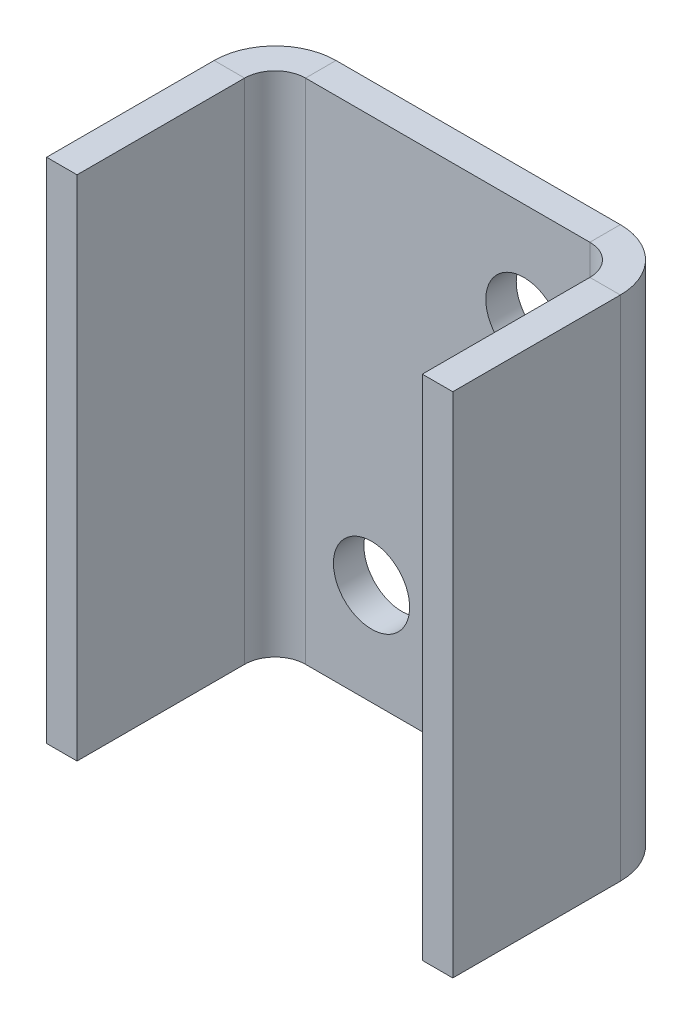
ISO-10303-21;
HEADER;
FILE_DESCRIPTION(('STEP AP214'),'2;1');
FILE_NAME('part.step','',(''),(''),'','','');
FILE_SCHEMA(('AUTOMOTIVE_DESIGN { 1 0 10303 214 1 1 1 1 }'));
ENDSEC;
DATA;
#1=APPLICATION_CONTEXT('core data for automotive mechanical design processes');
#2=APPLICATION_PROTOCOL_DEFINITION('international standard','automotive_design',2000,#1);
#3=PRODUCT_CONTEXT('',#1,'mechanical');
#4=PRODUCT('Part','Part','',(#3));
#5=PRODUCT_RELATED_PRODUCT_CATEGORY('part','',(#4));
#6=PRODUCT_DEFINITION_FORMATION('','',#4);
#7=PRODUCT_DEFINITION_CONTEXT('part definition',#1,'design');
#8=PRODUCT_DEFINITION('design','',#6,#7);
#9=PRODUCT_DEFINITION_SHAPE('','',#8);
#10=(LENGTH_UNIT() NAMED_UNIT(*) SI_UNIT(.MILLI.,.METRE.));
#11=(NAMED_UNIT(*) PLANE_ANGLE_UNIT() SI_UNIT($,.RADIAN.));
#12=(NAMED_UNIT(*) SI_UNIT($,.STERADIAN.) SOLID_ANGLE_UNIT());
#13=UNCERTAINTY_MEASURE_WITH_UNIT(LENGTH_MEASURE(1.E-05),#10,'distance_accuracy_value','');
#14=(GEOMETRIC_REPRESENTATION_CONTEXT(3) GLOBAL_UNCERTAINTY_ASSIGNED_CONTEXT((#13)) GLOBAL_UNIT_ASSIGNED_CONTEXT((#10,
#11,#12)) REPRESENTATION_CONTEXT('',''));
#15=CARTESIAN_POINT('',(0.,0.,0.));
#16=DIRECTION('',(0.,0.,1.));
#17=DIRECTION('',(1.,0.,0.));
#18=AXIS2_PLACEMENT_3D('',#15,#16,#17);
#19=CARTESIAN_POINT('',(-28.,0.,-10.5));
#20=DIRECTION('',(0.,-1.,0.));
#21=DIRECTION('',(0.,0.,-1.));
#22=AXIS2_PLACEMENT_3D('',#19,#20,#21);
#23=PLANE('',#22);
#24=DIRECTION('',(0.,0.,-1.));
#25=VECTOR('',#24,1.);
#26=CARTESIAN_POINT('',(-28.,0.,-22.5));
#27=LINE('',#26,#25);
#28=CARTESIAN_POINT('',(-28.,0.,-16.5));
#29=VERTEX_POINT('',#28);
#30=CARTESIAN_POINT('',(-28.,0.,-22.5));
#31=VERTEX_POINT('',#30);
#32=EDGE_CURVE('E11',#29,#31,#27,.T.);
#33=ORIENTED_EDGE('',*,*,#32,.F.);
#34=CARTESIAN_POINT('',(-28.,0.,-10.5));
#35=DIRECTION('',(0.,-1.,0.));
#36=DIRECTION('',(0.,0.,-1.));
#37=AXIS2_PLACEMENT_3D('',#34,#35,#36);
#38=CIRCLE('',#37,6.);
#39=CARTESIAN_POINT('',(-34.,0.,-10.5));
#40=VERTEX_POINT('',#39);
#41=EDGE_CURVE('E104',#29,#40,#38,.F.);
#42=ORIENTED_EDGE('',*,*,#41,.T.);
#43=DIRECTION('',(-1.,0.,0.));
#44=VECTOR('',#43,1.);
#45=CARTESIAN_POINT('',(-40.,0.,-10.5));
#46=LINE('',#45,#44);
#47=CARTESIAN_POINT('',(-40.,0.,-10.5));
#48=VERTEX_POINT('',#47);
#49=EDGE_CURVE('E52',#40,#48,#46,.T.);
#50=ORIENTED_EDGE('',*,*,#49,.T.);
#51=CARTESIAN_POINT('',(-28.,0.,-10.5));
#52=DIRECTION('',(0.,1.,0.));
#53=DIRECTION('',(0.,0.,1.));
#54=AXIS2_PLACEMENT_3D('',#51,#52,#53);
#55=CIRCLE('',#54,12.);
#56=EDGE_CURVE('E107',#31,#48,#55,.T.);
#57=ORIENTED_EDGE('',*,*,#56,.F.);
#58=EDGE_LOOP('',(#33,#42,#50,#57));
#59=FACE_BOUND('',#58,.T.);
#60=ADVANCED_FACE('F41',(#59),#23,.T.);
#61=CARTESIAN_POINT('',(-40.,0.,-22.5));
#62=DIRECTION('',(0.,1.,0.));
#63=DIRECTION('',(0.,0.,1.));
#64=AXIS2_PLACEMENT_3D('',#61,#62,#63);
#65=PLANE('',#64);
#66=ORIENTED_EDGE('',*,*,#49,.F.);
#67=DIRECTION('',(0.,0.,-1.));
#68=VECTOR('',#67,1.);
#69=CARTESIAN_POINT('',(-34.,0.,-22.5));
#70=LINE('',#69,#68);
#71=CARTESIAN_POINT('',(-34.,0.,22.5));
#72=VERTEX_POINT('',#71);
#73=EDGE_CURVE('E311',#40,#72,#70,.F.);
#74=ORIENTED_EDGE('',*,*,#73,.T.);
#75=DIRECTION('',(-1.,0.,0.));
#76=VECTOR('',#75,1.);
#77=CARTESIAN_POINT('',(-40.,0.,22.5));
#78=LINE('',#77,#76);
#79=CARTESIAN_POINT('',(-40.,0.,22.5));
#80=VERTEX_POINT('',#79);
#81=EDGE_CURVE('E184',#72,#80,#78,.T.);
#82=ORIENTED_EDGE('',*,*,#81,.T.);
#83=DIRECTION('',(0.,0.,1.));
#84=VECTOR('',#83,1.);
#85=CARTESIAN_POINT('',(-40.,0.,-22.5));
#86=LINE('',#85,#84);
#87=EDGE_CURVE('E209',#48,#80,#86,.T.);
#88=ORIENTED_EDGE('',*,*,#87,.F.);
#89=EDGE_LOOP('',(#66,#74,#82,#88));
#90=FACE_BOUND('',#89,.T.);
#91=ADVANCED_FACE('F210',(#90),#65,.F.);
#92=CARTESIAN_POINT('',(-40.,100.,22.5));
#93=DIRECTION('',(0.,0.,1.));
#94=DIRECTION('',(0.,-1.,0.));
#95=AXIS2_PLACEMENT_3D('',#92,#93,#94);
#96=PLANE('',#95);
#97=ORIENTED_EDGE('',*,*,#81,.F.);
#98=DIRECTION('',(0.,1.,0.));
#99=VECTOR('',#98,1.);
#100=CARTESIAN_POINT('',(-34.,100.,22.5));
#101=LINE('',#100,#99);
#102=CARTESIAN_POINT('',(-34.,100.,22.5));
#103=VERTEX_POINT('',#102);
#104=EDGE_CURVE('E308',#103,#72,#101,.F.);
#105=ORIENTED_EDGE('',*,*,#104,.F.);
#106=DIRECTION('',(-1.,0.,0.));
#107=VECTOR('',#106,1.);
#108=CARTESIAN_POINT('',(-40.,100.,22.5));
#109=LINE('',#108,#107);
#110=CARTESIAN_POINT('',(-40.,100.,22.5));
#111=VERTEX_POINT('',#110);
#112=EDGE_CURVE('E180',#103,#111,#109,.T.);
#113=ORIENTED_EDGE('',*,*,#112,.T.);
#114=DIRECTION('',(0.,-1.,0.));
#115=VECTOR('',#114,1.);
#116=CARTESIAN_POINT('',(-40.,100.,22.5));
#117=LINE('',#116,#115);
#118=EDGE_CURVE('E215',#111,#80,#117,.T.);
#119=ORIENTED_EDGE('',*,*,#118,.T.);
#120=EDGE_LOOP('',(#97,#105,#113,#119));
#121=FACE_BOUND('',#120,.T.);
#122=ADVANCED_FACE('F319',(#121),#96,.T.);
#123=CARTESIAN_POINT('',(-40.,100.,-22.5));
#124=DIRECTION('',(0.,1.,0.));
#125=DIRECTION('',(0.,0.,1.));
#126=AXIS2_PLACEMENT_3D('',#123,#124,#125);
#127=PLANE('',#126);
#128=ORIENTED_EDGE('',*,*,#112,.F.);
#129=DIRECTION('',(0.,0.,-1.));
#130=VECTOR('',#129,1.);
#131=CARTESIAN_POINT('',(-34.,100.,-22.5));
#132=LINE('',#131,#130);
#133=CARTESIAN_POINT('',(-34.,100.,-10.5));
#134=VERTEX_POINT('',#133);
#135=EDGE_CURVE('E285',#134,#103,#132,.F.);
#136=ORIENTED_EDGE('',*,*,#135,.F.);
#137=DIRECTION('',(-1.,0.,0.));
#138=VECTOR('',#137,1.);
#139=CARTESIAN_POINT('',(-40.,100.,-10.5));
#140=LINE('',#139,#138);
#141=CARTESIAN_POINT('',(-40.,100.,-10.5));
#142=VERTEX_POINT('',#141);
#143=EDGE_CURVE('E176',#134,#142,#140,.T.);
#144=ORIENTED_EDGE('',*,*,#143,.T.);
#145=DIRECTION('',(0.,0.,1.));
#146=VECTOR('',#145,1.);
#147=CARTESIAN_POINT('',(-40.,100.,-22.5));
#148=LINE('',#147,#146);
#149=EDGE_CURVE('E221',#142,#111,#148,.T.);
#150=ORIENTED_EDGE('',*,*,#149,.T.);
#151=EDGE_LOOP('',(#128,#136,#144,#150));
#152=FACE_BOUND('',#151,.T.);
#153=ADVANCED_FACE('F339',(#152),#127,.T.);
#154=CARTESIAN_POINT('',(-28.,100.,-10.5));
#155=DIRECTION('',(0.,-1.,0.));
#156=DIRECTION('',(0.,0.,-1.));
#157=AXIS2_PLACEMENT_3D('',#154,#155,#156);
#158=PLANE('',#157);
#159=ORIENTED_EDGE('',*,*,#143,.F.);
#160=CARTESIAN_POINT('',(-28.,100.,-10.5));
#161=DIRECTION('',(0.,-1.,0.));
#162=DIRECTION('',(0.,0.,-1.));
#163=AXIS2_PLACEMENT_3D('',#160,#161,#162);
#164=CIRCLE('',#163,6.);
#165=CARTESIAN_POINT('',(-28.,100.,-16.5));
#166=VERTEX_POINT('',#165);
#167=EDGE_CURVE('E135',#166,#134,#164,.F.);
#168=ORIENTED_EDGE('',*,*,#167,.F.);
#169=DIRECTION('',(0.,0.,-1.));
#170=VECTOR('',#169,1.);
#171=CARTESIAN_POINT('',(-28.,100.,-22.5));
#172=LINE('',#171,#170);
#173=CARTESIAN_POINT('',(-28.,100.,-22.5));
#174=VERTEX_POINT('',#173);
#175=EDGE_CURVE('E172',#166,#174,#172,.T.);
#176=ORIENTED_EDGE('',*,*,#175,.T.);
#177=CARTESIAN_POINT('',(-28.,100.,-10.5));
#178=DIRECTION('',(0.,1.,0.));
#179=DIRECTION('',(0.,0.,1.));
#180=AXIS2_PLACEMENT_3D('',#177,#178,#179);
#181=CIRCLE('',#180,12.);
#182=EDGE_CURVE('E205',#174,#142,#181,.T.);
#183=ORIENTED_EDGE('',*,*,#182,.T.);
#184=EDGE_LOOP('',(#159,#168,#176,#183));
#185=FACE_BOUND('',#184,.T.);
#186=ADVANCED_FACE('F342',(#185),#158,.F.);
#187=CARTESIAN_POINT('',(40.,100.,-22.5));
#188=DIRECTION('',(0.,1.,0.));
#189=DIRECTION('',(-1.,0.,0.));
#190=AXIS2_PLACEMENT_3D('',#187,#188,#189);
#191=PLANE('',#190);
#192=ORIENTED_EDGE('',*,*,#175,.F.);
#193=DIRECTION('',(1.,0.,0.));
#194=VECTOR('',#193,1.);
#195=CARTESIAN_POINT('',(40.,100.,-16.5));
#196=LINE('',#195,#194);
#197=CARTESIAN_POINT('',(28.,100.,-16.5));
#198=VERTEX_POINT('',#197);
#199=EDGE_CURVE('E123',#198,#166,#196,.F.);
#200=ORIENTED_EDGE('',*,*,#199,.F.);
#201=DIRECTION('',(0.,0.,-1.));
#202=VECTOR('',#201,1.);
#203=CARTESIAN_POINT('',(28.,100.,-22.5));
#204=LINE('',#203,#202);
#205=CARTESIAN_POINT('',(28.,100.,-22.5));
#206=VERTEX_POINT('',#205);
#207=EDGE_CURVE('E168',#198,#206,#204,.T.);
#208=ORIENTED_EDGE('',*,*,#207,.T.);
#209=DIRECTION('',(-1.,0.,0.));
#210=VECTOR('',#209,1.);
#211=CARTESIAN_POINT('',(40.,100.,-22.5));
#212=LINE('',#211,#210);
#213=EDGE_CURVE('E243',#206,#174,#212,.T.);
#214=ORIENTED_EDGE('',*,*,#213,.T.);
#215=EDGE_LOOP('',(#192,#200,#208,#214));
#216=FACE_BOUND('',#215,.T.);
#217=ADVANCED_FACE('F348',(#216),#191,.T.);
#218=CARTESIAN_POINT('',(28.,100.,-10.5));
#219=DIRECTION('',(0.,-1.,0.));
#220=DIRECTION('',(0.,0.,-1.));
#221=AXIS2_PLACEMENT_3D('',#218,#219,#220);
#222=PLANE('',#221);
#223=ORIENTED_EDGE('',*,*,#207,.F.);
#224=CARTESIAN_POINT('',(28.,100.,-10.5));
#225=DIRECTION('',(0.,-1.,0.));
#226=DIRECTION('',(0.,0.,-1.));
#227=AXIS2_PLACEMENT_3D('',#224,#225,#226);
#228=CIRCLE('',#227,6.);
#229=CARTESIAN_POINT('',(34.,100.,-10.5));
#230=VERTEX_POINT('',#229);
#231=EDGE_CURVE('E216',#230,#198,#228,.F.);
#232=ORIENTED_EDGE('',*,*,#231,.F.);
#233=DIRECTION('',(1.,0.,0.));
#234=VECTOR('',#233,1.);
#235=CARTESIAN_POINT('',(40.,100.,-10.5));
#236=LINE('',#235,#234);
#237=CARTESIAN_POINT('',(40.,100.,-10.5));
#238=VERTEX_POINT('',#237);
#239=EDGE_CURVE('E164',#230,#238,#236,.T.);
#240=ORIENTED_EDGE('',*,*,#239,.T.);
#241=CARTESIAN_POINT('',(28.,100.,-10.5));
#242=DIRECTION('',(0.,1.,0.));
#243=DIRECTION('',(0.,0.,1.));
#244=AXIS2_PLACEMENT_3D('',#241,#242,#243);
#245=CIRCLE('',#244,12.);
#246=EDGE_CURVE('E271',#238,#206,#245,.T.);
#247=ORIENTED_EDGE('',*,*,#246,.T.);
#248=EDGE_LOOP('',(#223,#232,#240,#247));
#249=FACE_BOUND('',#248,.T.);
#250=ADVANCED_FACE('F362',(#249),#222,.F.);
#251=CARTESIAN_POINT('',(40.,100.,-22.5));
#252=DIRECTION('',(0.,1.,0.));
#253=DIRECTION('',(0.,0.,-1.));
#254=AXIS2_PLACEMENT_3D('',#251,#252,#253);
#255=PLANE('',#254);
#256=ORIENTED_EDGE('',*,*,#239,.F.);
#257=DIRECTION('',(0.,0.,1.));
#258=VECTOR('',#257,1.);
#259=CARTESIAN_POINT('',(34.,100.,-22.5));
#260=LINE('',#259,#258);
#261=CARTESIAN_POINT('',(34.,100.,22.5));
#262=VERTEX_POINT('',#261);
#263=EDGE_CURVE('E280',#262,#230,#260,.F.);
#264=ORIENTED_EDGE('',*,*,#263,.F.);
#265=DIRECTION('',(1.,0.,0.));
#266=VECTOR('',#265,1.);
#267=CARTESIAN_POINT('',(40.,100.,22.5));
#268=LINE('',#267,#266);
#269=CARTESIAN_POINT('',(40.,100.,22.5));
#270=VERTEX_POINT('',#269);
#271=EDGE_CURVE('E161',#262,#270,#268,.T.);
#272=ORIENTED_EDGE('',*,*,#271,.T.);
#273=DIRECTION('',(0.,0.,-1.));
#274=VECTOR('',#273,1.);
#275=CARTESIAN_POINT('',(40.,100.,-22.5));
#276=LINE('',#275,#274);
#277=EDGE_CURVE('E260',#270,#238,#276,.T.);
#278=ORIENTED_EDGE('',*,*,#277,.T.);
#279=EDGE_LOOP('',(#256,#264,#272,#278));
#280=FACE_BOUND('',#279,.T.);
#281=ADVANCED_FACE('F368',(#280),#255,.T.);
#282=CARTESIAN_POINT('',(40.,100.,22.5));
#283=DIRECTION('',(0.,0.,-1.));
#284=DIRECTION('',(0.,-1.,0.));
#285=AXIS2_PLACEMENT_3D('',#282,#283,#284);
#286=PLANE('',#285);
#287=ORIENTED_EDGE('',*,*,#271,.F.);
#288=DIRECTION('',(0.,1.,0.));
#289=VECTOR('',#288,1.);
#290=CARTESIAN_POINT('',(34.,100.,22.5));
#291=LINE('',#290,#289);
#292=CARTESIAN_POINT('',(34.,0.,22.5));
#293=VERTEX_POINT('',#292);
#294=EDGE_CURVE('E289',#262,#293,#291,.F.);
#295=ORIENTED_EDGE('',*,*,#294,.T.);
#296=DIRECTION('',(1.,0.,0.));
#297=VECTOR('',#296,1.);
#298=CARTESIAN_POINT('',(40.,0.,22.5));
#299=LINE('',#298,#297);
#300=CARTESIAN_POINT('',(40.,0.,22.5));
#301=VERTEX_POINT('',#300);
#302=EDGE_CURVE('E60',#293,#301,#299,.T.);
#303=ORIENTED_EDGE('',*,*,#302,.T.);
#304=DIRECTION('',(0.,-1.,0.));
#305=VECTOR('',#304,1.);
#306=CARTESIAN_POINT('',(40.,100.,22.5));
#307=LINE('',#306,#305);
#308=EDGE_CURVE('E264',#270,#301,#307,.T.);
#309=ORIENTED_EDGE('',*,*,#308,.F.);
#310=EDGE_LOOP('',(#287,#295,#303,#309));
#311=FACE_BOUND('',#310,.T.);
#312=ADVANCED_FACE('F386',(#311),#286,.F.);
#313=CARTESIAN_POINT('',(40.,0.,-22.5));
#314=DIRECTION('',(0.,1.,0.));
#315=DIRECTION('',(0.,0.,-1.));
#316=AXIS2_PLACEMENT_3D('',#313,#314,#315);
#317=PLANE('',#316);
#318=ORIENTED_EDGE('',*,*,#302,.F.);
#319=DIRECTION('',(0.,0.,1.));
#320=VECTOR('',#319,1.);
#321=CARTESIAN_POINT('',(34.,0.,-22.5));
#322=LINE('',#321,#320);
#323=CARTESIAN_POINT('',(34.,0.,-10.5));
#324=VERTEX_POINT('',#323);
#325=EDGE_CURVE('E281',#293,#324,#322,.F.);
#326=ORIENTED_EDGE('',*,*,#325,.T.);
#327=DIRECTION('',(1.,0.,0.));
#328=VECTOR('',#327,1.);
#329=CARTESIAN_POINT('',(40.,0.,-10.5));
#330=LINE('',#329,#328);
#331=CARTESIAN_POINT('',(40.,0.,-10.5));
#332=VERTEX_POINT('',#331);
#333=EDGE_CURVE('E155',#324,#332,#330,.T.);
#334=ORIENTED_EDGE('',*,*,#333,.T.);
#335=DIRECTION('',(0.,0.,-1.));
#336=VECTOR('',#335,1.);
#337=CARTESIAN_POINT('',(40.,0.,-22.5));
#338=LINE('',#337,#336);
#339=EDGE_CURVE('E252',#301,#332,#338,.T.);
#340=ORIENTED_EDGE('',*,*,#339,.F.);
#341=EDGE_LOOP('',(#318,#326,#334,#340));
#342=FACE_BOUND('',#341,.T.);
#343=ADVANCED_FACE('F384',(#342),#317,.F.);
#344=CARTESIAN_POINT('',(28.,0.,-10.5));
#345=DIRECTION('',(0.,-1.,0.));
#346=DIRECTION('',(0.,0.,-1.));
#347=AXIS2_PLACEMENT_3D('',#344,#345,#346);
#348=PLANE('',#347);
#349=ORIENTED_EDGE('',*,*,#333,.F.);
#350=CARTESIAN_POINT('',(28.,0.,-10.5));
#351=DIRECTION('',(0.,-1.,0.));
#352=DIRECTION('',(0.,0.,-1.));
#353=AXIS2_PLACEMENT_3D('',#350,#351,#352);
#354=CIRCLE('',#353,6.);
#355=CARTESIAN_POINT('',(28.,0.,-16.5));
#356=VERTEX_POINT('',#355);
#357=EDGE_CURVE('E286',#324,#356,#354,.F.);
#358=ORIENTED_EDGE('',*,*,#357,.T.);
#359=DIRECTION('',(0.,0.,-1.));
#360=VECTOR('',#359,1.);
#361=CARTESIAN_POINT('',(28.,0.,-22.5));
#362=LINE('',#361,#360);
#363=CARTESIAN_POINT('',(28.,0.,-22.5));
#364=VERTEX_POINT('',#363);
#365=EDGE_CURVE('E45',#356,#364,#362,.T.);
#366=ORIENTED_EDGE('',*,*,#365,.T.);
#367=CARTESIAN_POINT('',(28.,0.,-10.5));
#368=DIRECTION('',(0.,1.,0.));
#369=DIRECTION('',(0.,0.,1.));
#370=AXIS2_PLACEMENT_3D('',#367,#368,#369);
#371=CIRCLE('',#370,12.);
#372=EDGE_CURVE('E267',#332,#364,#371,.T.);
#373=ORIENTED_EDGE('',*,*,#372,.F.);
#374=EDGE_LOOP('',(#349,#358,#366,#373));
#375=FACE_BOUND('',#374,.T.);
#376=ADVANCED_FACE('F376',(#375),#348,.T.);
#377=CARTESIAN_POINT('',(15.,80.,-22.5));
#378=DIRECTION('',(0.,0.,1.));
#379=DIRECTION('',(1.,0.,0.));
#380=AXIS2_PLACEMENT_3D('',#377,#378,#379);
#381=CYLINDRICAL_SURFACE('',#380,7.5);
#382=CARTESIAN_POINT('',(15.,80.,-22.5));
#383=DIRECTION('',(0.,0.,-1.));
#384=DIRECTION('',(-1.,0.,0.));
#385=AXIS2_PLACEMENT_3D('',#382,#383,#384);
#386=CIRCLE('',#385,7.5);
#387=CARTESIAN_POINT('',(7.50000000000001,80.,-22.5));
#388=VERTEX_POINT('',#387);
#389=EDGE_CURVE('E224',#388,#388,#386,.T.);
#390=ORIENTED_EDGE('',*,*,#389,.T.);
#391=EDGE_LOOP('',(#390));
#392=FACE_BOUND('',#391,.T.);
#393=CARTESIAN_POINT('',(15.,80.,-16.5));
#394=DIRECTION('',(0.,0.,-1.));
#395=DIRECTION('',(-1.,0.,0.));
#396=AXIS2_PLACEMENT_3D('',#393,#394,#395);
#397=CIRCLE('',#396,7.5);
#398=CARTESIAN_POINT('',(7.50000000000001,80.,-16.5));
#399=VERTEX_POINT('',#398);
#400=EDGE_CURVE('E148',#399,#399,#397,.T.);
#401=ORIENTED_EDGE('',*,*,#400,.F.);
#402=EDGE_LOOP('',(#401));
#403=FACE_BOUND('',#402,.T.);
#404=ADVANCED_FACE('F392',(#392,#403),#381,.F.);
#405=CARTESIAN_POINT('',(-15.,20.,-22.5));
#406=DIRECTION('',(0.,0.,1.));
#407=DIRECTION('',(1.,0.,0.));
#408=AXIS2_PLACEMENT_3D('',#405,#406,#407);
#409=CYLINDRICAL_SURFACE('',#408,7.5);
#410=CARTESIAN_POINT('',(-15.,20.,-22.5));
#411=DIRECTION('',(0.,0.,-1.));
#412=DIRECTION('',(-1.,0.,0.));
#413=AXIS2_PLACEMENT_3D('',#410,#411,#412);
#414=CIRCLE('',#413,7.5);
#415=CARTESIAN_POINT('',(-22.5,20.,-22.5));
#416=VERTEX_POINT('',#415);
#417=EDGE_CURVE('E230',#416,#416,#414,.T.);
#418=ORIENTED_EDGE('',*,*,#417,.T.);
#419=EDGE_LOOP('',(#418));
#420=FACE_BOUND('',#419,.T.);
#421=CARTESIAN_POINT('',(-15.,20.,-16.5));
#422=DIRECTION('',(0.,0.,-1.));
#423=DIRECTION('',(-1.,0.,0.));
#424=AXIS2_PLACEMENT_3D('',#421,#422,#423);
#425=CIRCLE('',#424,7.5);
#426=CARTESIAN_POINT('',(-22.5,20.,-16.5));
#427=VERTEX_POINT('',#426);
#428=EDGE_CURVE('E143',#427,#427,#425,.T.);
#429=ORIENTED_EDGE('',*,*,#428,.F.);
#430=EDGE_LOOP('',(#429));
#431=FACE_BOUND('',#430,.T.);
#432=ADVANCED_FACE('F43',(#420,#431),#409,.F.);
#433=CARTESIAN_POINT('',(40.,0.,-22.5));
#434=DIRECTION('',(0.,1.,0.));
#435=DIRECTION('',(-1.,0.,0.));
#436=AXIS2_PLACEMENT_3D('',#433,#434,#435);
#437=PLANE('',#436);
#438=DIRECTION('',(1.,0.,0.));
#439=VECTOR('',#438,1.);
#440=CARTESIAN_POINT('',(40.,0.,-16.5));
#441=LINE('',#440,#439);
#442=EDGE_CURVE('E120',#356,#29,#441,.F.);
#443=ORIENTED_EDGE('',*,*,#442,.T.);
#444=ORIENTED_EDGE('',*,*,#32,.T.);
#445=DIRECTION('',(-1.,0.,0.));
#446=VECTOR('',#445,1.);
#447=CARTESIAN_POINT('',(40.,0.,-22.5));
#448=LINE('',#447,#446);
#449=EDGE_CURVE('E238',#364,#31,#448,.T.);
#450=ORIENTED_EDGE('',*,*,#449,.F.);
#451=ORIENTED_EDGE('',*,*,#365,.F.);
#452=EDGE_LOOP('',(#443,#444,#450,#451));
#453=FACE_BOUND('',#452,.T.);
#454=ADVANCED_FACE('F139',(#453),#437,.F.);
#455=CARTESIAN_POINT('',(28.,100.,-10.5));
#456=DIRECTION('',(0.,-1.,0.));
#457=DIRECTION('',(0.,0.,-1.));
#458=AXIS2_PLACEMENT_3D('',#455,#456,#457);
#459=CYLINDRICAL_SURFACE('',#458,12.);
#460=ORIENTED_EDGE('',*,*,#372,.T.);
#461=DIRECTION('',(0.,-1.,0.));
#462=VECTOR('',#461,1.);
#463=CARTESIAN_POINT('',(28.,100.,-22.5));
#464=LINE('',#463,#462);
#465=EDGE_CURVE('E206',#206,#364,#464,.T.);
#466=ORIENTED_EDGE('',*,*,#465,.F.);
#467=ORIENTED_EDGE('',*,*,#246,.F.);
#468=DIRECTION('',(0.,-1.,0.));
#469=VECTOR('',#468,1.);
#470=CARTESIAN_POINT('',(40.,100.,-10.5));
#471=LINE('',#470,#469);
#472=EDGE_CURVE('E256',#238,#332,#471,.T.);
#473=ORIENTED_EDGE('',*,*,#472,.T.);
#474=EDGE_LOOP('',(#460,#466,#467,#473));
#475=FACE_BOUND('',#474,.T.);
#476=ADVANCED_FACE('F372',(#475),#459,.T.);
#477=CARTESIAN_POINT('',(40.,100.,-22.5));
#478=DIRECTION('',(-1.,0.,0.));
#479=DIRECTION('',(0.,0.,1.));
#480=AXIS2_PLACEMENT_3D('',#477,#478,#479);
#481=PLANE('',#480);
#482=ORIENTED_EDGE('',*,*,#339,.T.);
#483=ORIENTED_EDGE('',*,*,#472,.F.);
#484=ORIENTED_EDGE('',*,*,#277,.F.);
#485=ORIENTED_EDGE('',*,*,#308,.T.);
#486=EDGE_LOOP('',(#482,#483,#484,#485));
#487=FACE_BOUND('',#486,.T.);
#488=ADVANCED_FACE('F373',(#487),#481,.F.);
#489=CARTESIAN_POINT('',(-28.,100.,-10.5));
#490=DIRECTION('',(0.,-1.,0.));
#491=DIRECTION('',(0.,0.,-1.));
#492=AXIS2_PLACEMENT_3D('',#489,#490,#491);
#493=CYLINDRICAL_SURFACE('',#492,12.);
#494=ORIENTED_EDGE('',*,*,#56,.T.);
#495=DIRECTION('',(0.,-1.,0.));
#496=VECTOR('',#495,1.);
#497=CARTESIAN_POINT('',(-40.,100.,-10.5));
#498=LINE('',#497,#496);
#499=EDGE_CURVE('E201',#142,#48,#498,.T.);
#500=ORIENTED_EDGE('',*,*,#499,.F.);
#501=ORIENTED_EDGE('',*,*,#182,.F.);
#502=DIRECTION('',(0.,-1.,0.));
#503=VECTOR('',#502,1.);
#504=CARTESIAN_POINT('',(-28.,100.,-22.5));
#505=LINE('',#504,#503);
#506=EDGE_CURVE('E203',#174,#31,#505,.T.);
#507=ORIENTED_EDGE('',*,*,#506,.T.);
#508=EDGE_LOOP('',(#494,#500,#501,#507));
#509=FACE_BOUND('',#508,.T.);
#510=ADVANCED_FACE('F198',(#509),#493,.T.);
#511=CARTESIAN_POINT('',(40.,100.,-22.5));
#512=DIRECTION('',(0.,0.,1.));
#513=DIRECTION('',(1.,0.,0.));
#514=AXIS2_PLACEMENT_3D('',#511,#512,#513);
#515=PLANE('',#514);
#516=ORIENTED_EDGE('',*,*,#389,.F.);
#517=EDGE_LOOP('',(#516));
#518=FACE_BOUND('',#517,.T.);
#519=ORIENTED_EDGE('',*,*,#417,.F.);
#520=EDGE_LOOP('',(#519));
#521=FACE_BOUND('',#520,.T.);
#522=ORIENTED_EDGE('',*,*,#449,.T.);
#523=ORIENTED_EDGE('',*,*,#506,.F.);
#524=ORIENTED_EDGE('',*,*,#213,.F.);
#525=ORIENTED_EDGE('',*,*,#465,.T.);
#526=EDGE_LOOP('',(#522,#523,#524,#525));
#527=FACE_BOUND('',#526,.T.);
#528=ADVANCED_FACE('F350',(#518,#521,#527),#515,.F.);
#529=CARTESIAN_POINT('',(-40.,100.,-22.5));
#530=DIRECTION('',(1.,0.,0.));
#531=DIRECTION('',(0.,0.,-1.));
#532=AXIS2_PLACEMENT_3D('',#529,#530,#531);
#533=PLANE('',#532);
#534=ORIENTED_EDGE('',*,*,#87,.T.);
#535=ORIENTED_EDGE('',*,*,#118,.F.);
#536=ORIENTED_EDGE('',*,*,#149,.F.);
#537=ORIENTED_EDGE('',*,*,#499,.T.);
#538=EDGE_LOOP('',(#534,#535,#536,#537));
#539=FACE_BOUND('',#538,.T.);
#540=ADVANCED_FACE('F219',(#539),#533,.F.);
#541=CARTESIAN_POINT('',(28.,100.,-10.5));
#542=DIRECTION('',(0.,-1.,0.));
#543=DIRECTION('',(0.,0.,-1.));
#544=AXIS2_PLACEMENT_3D('',#541,#542,#543);
#545=CYLINDRICAL_SURFACE('',#544,6.);
#546=ORIENTED_EDGE('',*,*,#357,.F.);
#547=DIRECTION('',(0.,-1.,0.));
#548=VECTOR('',#547,1.);
#549=CARTESIAN_POINT('',(34.,100.,-10.5));
#550=LINE('',#549,#548);
#551=EDGE_CURVE('E277',#230,#324,#550,.T.);
#552=ORIENTED_EDGE('',*,*,#551,.F.);
#553=ORIENTED_EDGE('',*,*,#231,.T.);
#554=DIRECTION('',(0.,1.,0.));
#555=VECTOR('',#554,1.);
#556=CARTESIAN_POINT('',(28.,100.,-16.5));
#557=LINE('',#556,#555);
#558=EDGE_CURVE('E136',#198,#356,#557,.F.);
#559=ORIENTED_EDGE('',*,*,#558,.T.);
#560=EDGE_LOOP('',(#546,#552,#553,#559));
#561=FACE_BOUND('',#560,.T.);
#562=ADVANCED_FACE('F383',(#561),#545,.F.);
#563=CARTESIAN_POINT('',(34.,100.,-22.5));
#564=DIRECTION('',(-1.,0.,0.));
#565=DIRECTION('',(0.,0.,1.));
#566=AXIS2_PLACEMENT_3D('',#563,#564,#565);
#567=PLANE('',#566);
#568=ORIENTED_EDGE('',*,*,#325,.F.);
#569=ORIENTED_EDGE('',*,*,#294,.F.);
#570=ORIENTED_EDGE('',*,*,#263,.T.);
#571=ORIENTED_EDGE('',*,*,#551,.T.);
#572=EDGE_LOOP('',(#568,#569,#570,#571));
#573=FACE_BOUND('',#572,.T.);
#574=ADVANCED_FACE('F380',(#573),#567,.T.);
#575=CARTESIAN_POINT('',(-28.,100.,-10.5));
#576=DIRECTION('',(0.,-1.,0.));
#577=DIRECTION('',(0.,0.,-1.));
#578=AXIS2_PLACEMENT_3D('',#575,#576,#577);
#579=CYLINDRICAL_SURFACE('',#578,6.);
#580=ORIENTED_EDGE('',*,*,#41,.F.);
#581=DIRECTION('',(0.,-1.,0.));
#582=VECTOR('',#581,1.);
#583=CARTESIAN_POINT('',(-28.,100.,-16.5));
#584=LINE('',#583,#582);
#585=EDGE_CURVE('E117',#166,#29,#584,.T.);
#586=ORIENTED_EDGE('',*,*,#585,.F.);
#587=ORIENTED_EDGE('',*,*,#167,.T.);
#588=DIRECTION('',(0.,1.,0.));
#589=VECTOR('',#588,1.);
#590=CARTESIAN_POINT('',(-34.,100.,-10.5));
#591=LINE('',#590,#589);
#592=EDGE_CURVE('E132',#134,#40,#591,.F.);
#593=ORIENTED_EDGE('',*,*,#592,.T.);
#594=EDGE_LOOP('',(#580,#586,#587,#593));
#595=FACE_BOUND('',#594,.T.);
#596=ADVANCED_FACE('F130',(#595),#579,.F.);
#597=CARTESIAN_POINT('',(40.,100.,-16.5));
#598=DIRECTION('',(0.,0.,1.));
#599=DIRECTION('',(1.,0.,0.));
#600=AXIS2_PLACEMENT_3D('',#597,#598,#599);
#601=PLANE('',#600);
#602=ORIENTED_EDGE('',*,*,#400,.T.);
#603=EDGE_LOOP('',(#602));
#604=FACE_BOUND('',#603,.T.);
#605=ORIENTED_EDGE('',*,*,#428,.T.);
#606=EDGE_LOOP('',(#605));
#607=FACE_BOUND('',#606,.T.);
#608=ORIENTED_EDGE('',*,*,#442,.F.);
#609=ORIENTED_EDGE('',*,*,#558,.F.);
#610=ORIENTED_EDGE('',*,*,#199,.T.);
#611=ORIENTED_EDGE('',*,*,#585,.T.);
#612=EDGE_LOOP('',(#608,#609,#610,#611));
#613=FACE_BOUND('',#612,.T.);
#614=ADVANCED_FACE('F118',(#604,#607,#613),#601,.T.);
#615=CARTESIAN_POINT('',(-34.,100.,-22.5));
#616=DIRECTION('',(1.,0.,0.));
#617=DIRECTION('',(0.,0.,-1.));
#618=AXIS2_PLACEMENT_3D('',#615,#616,#617);
#619=PLANE('',#618);
#620=ORIENTED_EDGE('',*,*,#73,.F.);
#621=ORIENTED_EDGE('',*,*,#592,.F.);
#622=ORIENTED_EDGE('',*,*,#135,.T.);
#623=ORIENTED_EDGE('',*,*,#104,.T.);
#624=EDGE_LOOP('',(#620,#621,#622,#623));
#625=FACE_BOUND('',#624,.T.);
#626=ADVANCED_FACE('F315',(#625),#619,.T.);
#627=CLOSED_SHELL('',(#60,#91,#122,#153,#186,#217,#250,#281,#312,#343,#376,#404,#432,#454,#476,
#488,#510,#528,#540,#562,#574,#596,#614,#626));
#628=MANIFOLD_SOLID_BREP('B2',#627);
#629=ADVANCED_BREP_SHAPE_REPRESENTATION('',(#18,#628),#14);
#630=SHAPE_DEFINITION_REPRESENTATION(#9,#629);
ENDSEC;
END-ISO-10303-21;
